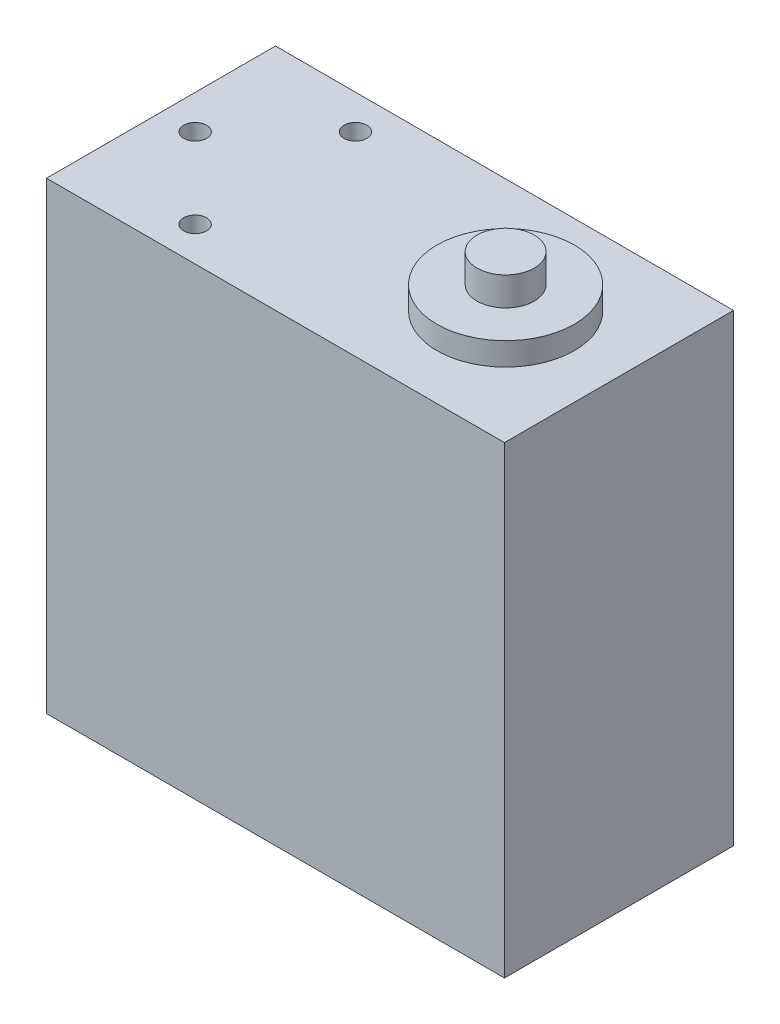
ISO-10303-21;
HEADER;
FILE_DESCRIPTION(('STEP AP214'),'2;1');
FILE_NAME('part.step','',(''),(''),'','','');
FILE_SCHEMA(('AUTOMOTIVE_DESIGN { 1 0 10303 214 1 1 1 1 }'));
ENDSEC;
DATA;
#1=APPLICATION_CONTEXT('core data for automotive mechanical design processes');
#2=APPLICATION_PROTOCOL_DEFINITION('international standard','automotive_design',2000,#1);
#3=PRODUCT_CONTEXT('',#1,'mechanical');
#4=PRODUCT('Part','Part','',(#3));
#5=PRODUCT_RELATED_PRODUCT_CATEGORY('part','',(#4));
#6=PRODUCT_DEFINITION_FORMATION('','',#4);
#7=PRODUCT_DEFINITION_CONTEXT('part definition',#1,'design');
#8=PRODUCT_DEFINITION('design','',#6,#7);
#9=PRODUCT_DEFINITION_SHAPE('','',#8);
#10=(LENGTH_UNIT() NAMED_UNIT(*) SI_UNIT(.MILLI.,.METRE.));
#11=(NAMED_UNIT(*) PLANE_ANGLE_UNIT() SI_UNIT($,.RADIAN.));
#12=(NAMED_UNIT(*) SI_UNIT($,.STERADIAN.) SOLID_ANGLE_UNIT());
#13=UNCERTAINTY_MEASURE_WITH_UNIT(LENGTH_MEASURE(1.E-05),#10,'distance_accuracy_value','');
#14=(GEOMETRIC_REPRESENTATION_CONTEXT(3) GLOBAL_UNCERTAINTY_ASSIGNED_CONTEXT((#13)) GLOBAL_UNIT_ASSIGNED_CONTEXT((#10,
#11,#12)) REPRESENTATION_CONTEXT('',''));
#15=CARTESIAN_POINT('',(0.,0.,0.));
#16=DIRECTION('',(0.,0.,1.));
#17=DIRECTION('',(1.,0.,0.));
#18=AXIS2_PLACEMENT_3D('',#15,#16,#17);
#19=CARTESIAN_POINT('',(0.,0.,20.));
#20=DIRECTION('',(1.,0.,0.));
#21=DIRECTION('',(0.,0.,-1.));
#22=AXIS2_PLACEMENT_3D('',#19,#20,#21);
#23=PLANE('',#22);
#24=DIRECTION('',(0.,-1.,0.));
#25=VECTOR('',#24,1.);
#26=CARTESIAN_POINT('',(0.,0.,0.));
#27=LINE('',#26,#25);
#28=CARTESIAN_POINT('',(0.,40.5,0.));
#29=VERTEX_POINT('',#28);
#30=CARTESIAN_POINT('',(0.,0.,0.));
#31=VERTEX_POINT('',#30);
#32=EDGE_CURVE('E102',#29,#31,#27,.T.);
#33=ORIENTED_EDGE('',*,*,#32,.T.);
#34=DIRECTION('',(0.,0.,-1.));
#35=VECTOR('',#34,1.);
#36=CARTESIAN_POINT('',(0.,0.,20.));
#37=LINE('',#36,#35);
#38=CARTESIAN_POINT('',(0.,0.,20.));
#39=VERTEX_POINT('',#38);
#40=EDGE_CURVE('E44',#39,#31,#37,.T.);
#41=ORIENTED_EDGE('',*,*,#40,.F.);
#42=DIRECTION('',(0.,-1.,0.));
#43=VECTOR('',#42,1.);
#44=CARTESIAN_POINT('',(0.,0.,20.));
#45=LINE('',#44,#43);
#46=CARTESIAN_POINT('',(0.,40.5,20.));
#47=VERTEX_POINT('',#46);
#48=EDGE_CURVE('E88',#47,#39,#45,.T.);
#49=ORIENTED_EDGE('',*,*,#48,.F.);
#50=DIRECTION('',(0.,0.,-1.));
#51=VECTOR('',#50,1.);
#52=CARTESIAN_POINT('',(0.,40.5,20.));
#53=LINE('',#52,#51);
#54=EDGE_CURVE('E98',#47,#29,#53,.T.);
#55=ORIENTED_EDGE('',*,*,#54,.T.);
#56=EDGE_LOOP('',(#33,#41,#49,#55));
#57=FACE_BOUND('',#56,.T.);
#58=ADVANCED_FACE('F36',(#57),#23,.F.);
#59=CARTESIAN_POINT('',(0.,0.,20.));
#60=DIRECTION('',(0.,1.,0.));
#61=DIRECTION('',(0.,0.,1.));
#62=AXIS2_PLACEMENT_3D('',#59,#60,#61);
#63=PLANE('',#62);
#64=CARTESIAN_POINT('',(17.5,0.,17.5));
#65=DIRECTION('',(0.,-1.,0.));
#66=DIRECTION('',(0.,0.,-1.));
#67=AXIS2_PLACEMENT_3D('',#64,#65,#66);
#68=CIRCLE('',#67,1.);
#69=CARTESIAN_POINT('',(17.5,0.,16.5));
#70=VERTEX_POINT('',#69);
#71=EDGE_CURVE('E279',#70,#70,#68,.T.);
#72=ORIENTED_EDGE('',*,*,#71,.F.);
#73=EDGE_LOOP('',(#72));
#74=FACE_BOUND('',#73,.T.);
#75=CARTESIAN_POINT('',(17.5000000000002,0.,2.5));
#76=DIRECTION('',(0.,-1.,0.));
#77=DIRECTION('',(0.,0.,-1.));
#78=AXIS2_PLACEMENT_3D('',#75,#76,#77);
#79=CIRCLE('',#78,1.);
#80=CARTESIAN_POINT('',(17.5000000000002,0.,1.5));
#81=VERTEX_POINT('',#80);
#82=EDGE_CURVE('E290',#81,#81,#79,.T.);
#83=ORIENTED_EDGE('',*,*,#82,.F.);
#84=EDGE_LOOP('',(#83));
#85=FACE_BOUND('',#84,.T.);
#86=CARTESIAN_POINT('',(2.50000000000016,0.,2.5));
#87=DIRECTION('',(0.,-1.,0.));
#88=DIRECTION('',(0.,0.,-1.));
#89=AXIS2_PLACEMENT_3D('',#86,#87,#88);
#90=CIRCLE('',#89,1.);
#91=CARTESIAN_POINT('',(2.50000000000016,0.,1.5));
#92=VERTEX_POINT('',#91);
#93=EDGE_CURVE('E296',#92,#92,#90,.T.);
#94=ORIENTED_EDGE('',*,*,#93,.F.);
#95=EDGE_LOOP('',(#94));
#96=FACE_BOUND('',#95,.T.);
#97=CARTESIAN_POINT('',(2.5,0.,17.5));
#98=DIRECTION('',(0.,-1.,0.));
#99=DIRECTION('',(0.,0.,-1.));
#100=AXIS2_PLACEMENT_3D('',#97,#98,#99);
#101=CIRCLE('',#100,1.);
#102=CARTESIAN_POINT('',(2.5,0.,16.5));
#103=VERTEX_POINT('',#102);
#104=EDGE_CURVE('E278',#103,#103,#101,.T.);
#105=ORIENTED_EDGE('',*,*,#104,.F.);
#106=EDGE_LOOP('',(#105));
#107=FACE_BOUND('',#106,.T.);
#108=CARTESIAN_POINT('',(30.1,0.,10.));
#109=DIRECTION('',(0.,1.,0.));
#110=DIRECTION('',(0.,0.,1.));
#111=AXIS2_PLACEMENT_3D('',#108,#109,#110);
#112=CIRCLE('',#111,6.);
#113=CARTESIAN_POINT('',(30.1,0.,16.));
#114=VERTEX_POINT('',#113);
#115=EDGE_CURVE('E176',#114,#114,#112,.T.);
#116=ORIENTED_EDGE('',*,*,#115,.T.);
#117=EDGE_LOOP('',(#116));
#118=FACE_BOUND('',#117,.T.);
#119=DIRECTION('',(1.,0.,0.));
#120=VECTOR('',#119,1.);
#121=CARTESIAN_POINT('',(0.,0.,0.));
#122=LINE('',#121,#120);
#123=CARTESIAN_POINT('',(40.,0.,0.));
#124=VERTEX_POINT('',#123);
#125=EDGE_CURVE('E93',#31,#124,#122,.T.);
#126=ORIENTED_EDGE('',*,*,#125,.T.);
#127=DIRECTION('',(0.,0.,-1.));
#128=VECTOR('',#127,1.);
#129=CARTESIAN_POINT('',(40.,0.,20.));
#130=LINE('',#129,#128);
#131=CARTESIAN_POINT('',(40.,0.,20.));
#132=VERTEX_POINT('',#131);
#133=EDGE_CURVE('E91',#132,#124,#130,.T.);
#134=ORIENTED_EDGE('',*,*,#133,.F.);
#135=DIRECTION('',(1.,0.,0.));
#136=VECTOR('',#135,1.);
#137=CARTESIAN_POINT('',(0.,0.,20.));
#138=LINE('',#137,#136);
#139=EDGE_CURVE('E83',#39,#132,#138,.T.);
#140=ORIENTED_EDGE('',*,*,#139,.F.);
#141=ORIENTED_EDGE('',*,*,#40,.T.);
#142=EDGE_LOOP('',(#126,#134,#140,#141));
#143=FACE_BOUND('',#142,.T.);
#144=ADVANCED_FACE('F92',(#74,#85,#96,#107,#118,#143),#63,.F.);
#145=CARTESIAN_POINT('',(40.,0.,20.));
#146=DIRECTION('',(-1.,0.,0.));
#147=DIRECTION('',(0.,0.,1.));
#148=AXIS2_PLACEMENT_3D('',#145,#146,#147);
#149=PLANE('',#148);
#150=DIRECTION('',(0.,1.,0.));
#151=VECTOR('',#150,1.);
#152=CARTESIAN_POINT('',(40.,0.,0.));
#153=LINE('',#152,#151);
#154=CARTESIAN_POINT('',(40.,40.5,0.));
#155=VERTEX_POINT('',#154);
#156=EDGE_CURVE('E69',#124,#155,#153,.T.);
#157=ORIENTED_EDGE('',*,*,#156,.T.);
#158=DIRECTION('',(0.,0.,-1.));
#159=VECTOR('',#158,1.);
#160=CARTESIAN_POINT('',(40.,40.5,20.));
#161=LINE('',#160,#159);
#162=CARTESIAN_POINT('',(40.,40.5,20.));
#163=VERTEX_POINT('',#162);
#164=EDGE_CURVE('E94',#163,#155,#161,.T.);
#165=ORIENTED_EDGE('',*,*,#164,.F.);
#166=DIRECTION('',(0.,1.,0.));
#167=VECTOR('',#166,1.);
#168=CARTESIAN_POINT('',(40.,0.,20.));
#169=LINE('',#168,#167);
#170=EDGE_CURVE('E86',#132,#163,#169,.T.);
#171=ORIENTED_EDGE('',*,*,#170,.F.);
#172=ORIENTED_EDGE('',*,*,#133,.T.);
#173=EDGE_LOOP('',(#157,#165,#171,#172));
#174=FACE_BOUND('',#173,.T.);
#175=ADVANCED_FACE('F96',(#174),#149,.F.);
#176=CARTESIAN_POINT('',(0.,40.5,20.));
#177=DIRECTION('',(0.,-1.,0.));
#178=DIRECTION('',(0.,0.,-1.));
#179=AXIS2_PLACEMENT_3D('',#176,#177,#178);
#180=PLANE('',#179);
#181=CARTESIAN_POINT('',(9.98000000000015,40.5,17.));
#182=DIRECTION('',(0.,1.,0.));
#183=DIRECTION('',(0.,0.,1.));
#184=AXIS2_PLACEMENT_3D('',#181,#182,#183);
#185=CIRCLE('',#184,1.);
#186=CARTESIAN_POINT('',(9.98000000000015,40.5,18.));
#187=VERTEX_POINT('',#186);
#188=EDGE_CURVE('E145',#187,#187,#185,.T.);
#189=ORIENTED_EDGE('',*,*,#188,.F.);
#190=EDGE_LOOP('',(#189));
#191=FACE_BOUND('',#190,.T.);
#192=CARTESIAN_POINT('',(2.98,40.5,10.));
#193=DIRECTION('',(0.,1.,0.));
#194=DIRECTION('',(0.,0.,1.));
#195=AXIS2_PLACEMENT_3D('',#192,#193,#194);
#196=CIRCLE('',#195,0.999999999999999);
#197=CARTESIAN_POINT('',(2.98,40.5,11.));
#198=VERTEX_POINT('',#197);
#199=EDGE_CURVE('E149',#198,#198,#196,.T.);
#200=ORIENTED_EDGE('',*,*,#199,.F.);
#201=EDGE_LOOP('',(#200));
#202=FACE_BOUND('',#201,.T.);
#203=CARTESIAN_POINT('',(9.98,40.5,3.));
#204=DIRECTION('',(0.,1.,0.));
#205=DIRECTION('',(0.,0.,1.));
#206=AXIS2_PLACEMENT_3D('',#203,#204,#205);
#207=CIRCLE('',#206,1.);
#208=CARTESIAN_POINT('',(9.98,40.5,4.));
#209=VERTEX_POINT('',#208);
#210=EDGE_CURVE('E153',#209,#209,#207,.T.);
#211=ORIENTED_EDGE('',*,*,#210,.F.);
#212=EDGE_LOOP('',(#211));
#213=FACE_BOUND('',#212,.T.);
#214=CARTESIAN_POINT('',(30.1,40.5,10.));
#215=DIRECTION('',(0.,-1.,0.));
#216=DIRECTION('',(0.,0.,-1.));
#217=AXIS2_PLACEMENT_3D('',#214,#215,#216);
#218=CIRCLE('',#217,6.);
#219=CARTESIAN_POINT('',(30.1,40.5,4.));
#220=VERTEX_POINT('',#219);
#221=EDGE_CURVE('E11',#220,#220,#218,.F.);
#222=ORIENTED_EDGE('',*,*,#221,.F.);
#223=EDGE_LOOP('',(#222));
#224=FACE_BOUND('',#223,.T.);
#225=DIRECTION('',(-1.,0.,0.));
#226=VECTOR('',#225,1.);
#227=CARTESIAN_POINT('',(0.,40.5,0.));
#228=LINE('',#227,#226);
#229=EDGE_CURVE('E75',#155,#29,#228,.T.);
#230=ORIENTED_EDGE('',*,*,#229,.T.);
#231=ORIENTED_EDGE('',*,*,#54,.F.);
#232=DIRECTION('',(-1.,0.,0.));
#233=VECTOR('',#232,1.);
#234=CARTESIAN_POINT('',(0.,40.5,20.));
#235=LINE('',#234,#233);
#236=EDGE_CURVE('E52',#163,#47,#235,.T.);
#237=ORIENTED_EDGE('',*,*,#236,.F.);
#238=ORIENTED_EDGE('',*,*,#164,.T.);
#239=EDGE_LOOP('',(#230,#231,#237,#238));
#240=FACE_BOUND('',#239,.T.);
#241=ADVANCED_FACE('F124',(#191,#202,#213,#224,#240),#180,.F.);
#242=CARTESIAN_POINT('',(0.,0.,20.));
#243=DIRECTION('',(0.,0.,-1.));
#244=DIRECTION('',(-1.,0.,0.));
#245=AXIS2_PLACEMENT_3D('',#242,#243,#244);
#246=PLANE('',#245);
#247=ORIENTED_EDGE('',*,*,#48,.T.);
#248=ORIENTED_EDGE('',*,*,#139,.T.);
#249=ORIENTED_EDGE('',*,*,#170,.T.);
#250=ORIENTED_EDGE('',*,*,#236,.T.);
#251=EDGE_LOOP('',(#247,#248,#249,#250));
#252=FACE_BOUND('',#251,.T.);
#253=ADVANCED_FACE('F84',(#252),#246,.F.);
#254=CARTESIAN_POINT('',(0.,0.,0.));
#255=DIRECTION('',(0.,0.,-1.));
#256=DIRECTION('',(-1.,0.,0.));
#257=AXIS2_PLACEMENT_3D('',#254,#255,#256);
#258=PLANE('',#257);
#259=ORIENTED_EDGE('',*,*,#32,.F.);
#260=ORIENTED_EDGE('',*,*,#229,.F.);
#261=ORIENTED_EDGE('',*,*,#156,.F.);
#262=ORIENTED_EDGE('',*,*,#125,.F.);
#263=EDGE_LOOP('',(#259,#260,#261,#262));
#264=FACE_BOUND('',#263,.T.);
#265=ADVANCED_FACE('F113',(#264),#258,.T.);
#266=CARTESIAN_POINT('',(30.1,42.5,10.));
#267=DIRECTION('',(0.,-1.,0.));
#268=DIRECTION('',(0.,0.,-1.));
#269=AXIS2_PLACEMENT_3D('',#266,#267,#268);
#270=CYLINDRICAL_SURFACE('',#269,6.);
#271=CARTESIAN_POINT('',(30.1,42.5,10.));
#272=DIRECTION('',(0.,1.,0.));
#273=DIRECTION('',(0.,0.,1.));
#274=AXIS2_PLACEMENT_3D('',#271,#272,#273);
#275=CIRCLE('',#274,6.);
#276=CARTESIAN_POINT('',(30.1,42.5,16.));
#277=VERTEX_POINT('',#276);
#278=EDGE_CURVE('E105',#277,#277,#275,.T.);
#279=ORIENTED_EDGE('',*,*,#278,.F.);
#280=EDGE_LOOP('',(#279));
#281=FACE_BOUND('',#280,.T.);
#282=ORIENTED_EDGE('',*,*,#221,.T.);
#283=EDGE_LOOP('',(#282));
#284=FACE_BOUND('',#283,.T.);
#285=ADVANCED_FACE('F115',(#281,#284),#270,.T.);
#286=CARTESIAN_POINT('',(30.1,42.5,10.));
#287=DIRECTION('',(0.,1.,0.));
#288=DIRECTION('',(0.,0.,1.));
#289=AXIS2_PLACEMENT_3D('',#286,#287,#288);
#290=PLANE('',#289);
#291=CARTESIAN_POINT('',(30.1,42.5,10.));
#292=DIRECTION('',(0.,1.,0.));
#293=DIRECTION('',(0.,0.,1.));
#294=AXIS2_PLACEMENT_3D('',#291,#292,#293);
#295=CIRCLE('',#294,2.5);
#296=CARTESIAN_POINT('',(30.1,42.5,12.5));
#297=VERTEX_POINT('',#296);
#298=EDGE_CURVE('E170',#297,#297,#295,.T.);
#299=ORIENTED_EDGE('',*,*,#298,.F.);
#300=EDGE_LOOP('',(#299));
#301=FACE_BOUND('',#300,.T.);
#302=ORIENTED_EDGE('',*,*,#278,.T.);
#303=EDGE_LOOP('',(#302));
#304=FACE_BOUND('',#303,.T.);
#305=ADVANCED_FACE('F121',(#301,#304),#290,.T.);
#306=CARTESIAN_POINT('',(30.1,-2.,10.));
#307=DIRECTION('',(0.,1.,0.));
#308=DIRECTION('',(0.,0.,1.));
#309=AXIS2_PLACEMENT_3D('',#306,#307,#308);
#310=CYLINDRICAL_SURFACE('',#309,6.);
#311=CARTESIAN_POINT('',(30.1,-2.,10.));
#312=DIRECTION('',(0.,1.,0.));
#313=DIRECTION('',(0.,0.,1.));
#314=AXIS2_PLACEMENT_3D('',#311,#312,#313);
#315=CIRCLE('',#314,6.);
#316=CARTESIAN_POINT('',(30.1,-2.,16.));
#317=VERTEX_POINT('',#316);
#318=EDGE_CURVE('E179',#317,#317,#315,.T.);
#319=ORIENTED_EDGE('',*,*,#318,.T.);
#320=EDGE_LOOP('',(#319));
#321=FACE_BOUND('',#320,.T.);
#322=ORIENTED_EDGE('',*,*,#115,.F.);
#323=EDGE_LOOP('',(#322));
#324=FACE_BOUND('',#323,.T.);
#325=ADVANCED_FACE('F188',(#321,#324),#310,.T.);
#326=CARTESIAN_POINT('',(30.1,-2.,10.));
#327=DIRECTION('',(0.,-1.,0.));
#328=DIRECTION('',(0.,0.,1.));
#329=AXIS2_PLACEMENT_3D('',#326,#327,#328);
#330=PLANE('',#329);
#331=CARTESIAN_POINT('',(30.1,-2.,10.));
#332=DIRECTION('',(0.,-1.,0.));
#333=DIRECTION('',(0.,0.,-1.));
#334=AXIS2_PLACEMENT_3D('',#331,#332,#333);
#335=CIRCLE('',#334,2.5);
#336=CARTESIAN_POINT('',(30.1,-2.,7.5));
#337=VERTEX_POINT('',#336);
#338=EDGE_CURVE('E161',#337,#337,#335,.T.);
#339=ORIENTED_EDGE('',*,*,#338,.F.);
#340=EDGE_LOOP('',(#339));
#341=FACE_BOUND('',#340,.T.);
#342=ORIENTED_EDGE('',*,*,#318,.F.);
#343=EDGE_LOOP('',(#342));
#344=FACE_BOUND('',#343,.T.);
#345=ADVANCED_FACE('F194',(#341,#344),#330,.T.);
#346=CARTESIAN_POINT('',(30.1,45.,10.));
#347=DIRECTION('',(0.,-1.,0.));
#348=DIRECTION('',(0.,0.,-1.));
#349=AXIS2_PLACEMENT_3D('',#346,#347,#348);
#350=CYLINDRICAL_SURFACE('',#349,2.5);
#351=CARTESIAN_POINT('',(30.1,45.,10.));
#352=DIRECTION('',(0.,1.,0.));
#353=DIRECTION('',(0.,0.,1.));
#354=AXIS2_PLACEMENT_3D('',#351,#352,#353);
#355=CIRCLE('',#354,2.5);
#356=CARTESIAN_POINT('',(30.1,45.,12.5));
#357=VERTEX_POINT('',#356);
#358=EDGE_CURVE('E173',#357,#357,#355,.T.);
#359=ORIENTED_EDGE('',*,*,#358,.F.);
#360=EDGE_LOOP('',(#359));
#361=FACE_BOUND('',#360,.T.);
#362=ORIENTED_EDGE('',*,*,#298,.T.);
#363=EDGE_LOOP('',(#362));
#364=FACE_BOUND('',#363,.T.);
#365=ADVANCED_FACE('F201',(#361,#364),#350,.T.);
#366=CARTESIAN_POINT('',(30.1,45.,10.));
#367=DIRECTION('',(0.,1.,0.));
#368=DIRECTION('',(0.,0.,1.));
#369=AXIS2_PLACEMENT_3D('',#366,#367,#368);
#370=PLANE('',#369);
#371=ORIENTED_EDGE('',*,*,#358,.T.);
#372=EDGE_LOOP('',(#371));
#373=FACE_BOUND('',#372,.T.);
#374=ADVANCED_FACE('F205',(#373),#370,.T.);
#375=CARTESIAN_POINT('',(30.1,-4.5,10.));
#376=DIRECTION('',(0.,1.,0.));
#377=DIRECTION('',(0.,0.,1.));
#378=AXIS2_PLACEMENT_3D('',#375,#376,#377);
#379=CYLINDRICAL_SURFACE('',#378,2.5);
#380=CARTESIAN_POINT('',(30.1,-4.5,10.));
#381=DIRECTION('',(0.,-1.,0.));
#382=DIRECTION('',(0.,0.,-1.));
#383=AXIS2_PLACEMENT_3D('',#380,#381,#382);
#384=CIRCLE('',#383,2.5);
#385=CARTESIAN_POINT('',(30.1,-4.5,7.5));
#386=VERTEX_POINT('',#385);
#387=EDGE_CURVE('E167',#386,#386,#384,.T.);
#388=ORIENTED_EDGE('',*,*,#387,.F.);
#389=EDGE_LOOP('',(#388));
#390=FACE_BOUND('',#389,.T.);
#391=ORIENTED_EDGE('',*,*,#338,.T.);
#392=EDGE_LOOP('',(#391));
#393=FACE_BOUND('',#392,.T.);
#394=ADVANCED_FACE('F209',(#390,#393),#379,.T.);
#395=CARTESIAN_POINT('',(30.1,-4.5,10.));
#396=DIRECTION('',(0.,-1.,0.));
#397=DIRECTION('',(0.,0.,-1.));
#398=AXIS2_PLACEMENT_3D('',#395,#396,#397);
#399=PLANE('',#398);
#400=ORIENTED_EDGE('',*,*,#387,.T.);
#401=EDGE_LOOP('',(#400));
#402=FACE_BOUND('',#401,.T.);
#403=ADVANCED_FACE('F213',(#402),#399,.T.);
#404=CARTESIAN_POINT('',(9.98,38.,3.));
#405=DIRECTION('',(0.,1.,0.));
#406=DIRECTION('',(0.,0.,1.));
#407=AXIS2_PLACEMENT_3D('',#404,#405,#406);
#408=CYLINDRICAL_SURFACE('',#407,1.);
#409=CARTESIAN_POINT('',(9.98,38.,3.));
#410=DIRECTION('',(0.,1.,0.));
#411=DIRECTION('',(0.,0.,1.));
#412=AXIS2_PLACEMENT_3D('',#409,#410,#411);
#413=CIRCLE('',#412,1.);
#414=CARTESIAN_POINT('',(9.98,38.,4.));
#415=VERTEX_POINT('',#414);
#416=EDGE_CURVE('E157',#415,#415,#413,.T.);
#417=ORIENTED_EDGE('',*,*,#416,.F.);
#418=EDGE_LOOP('',(#417));
#419=FACE_BOUND('',#418,.T.);
#420=ORIENTED_EDGE('',*,*,#210,.T.);
#421=EDGE_LOOP('',(#420));
#422=FACE_BOUND('',#421,.T.);
#423=ADVANCED_FACE('F217',(#419,#422),#408,.F.);
#424=CARTESIAN_POINT('',(9.98,38.,3.));
#425=DIRECTION('',(0.,1.,0.));
#426=DIRECTION('',(0.,0.,1.));
#427=AXIS2_PLACEMENT_3D('',#424,#425,#426);
#428=PLANE('',#427);
#429=ORIENTED_EDGE('',*,*,#416,.T.);
#430=EDGE_LOOP('',(#429));
#431=FACE_BOUND('',#430,.T.);
#432=ADVANCED_FACE('F221',(#431),#428,.T.);
#433=CARTESIAN_POINT('',(2.98,38.,10.));
#434=DIRECTION('',(0.,1.,0.));
#435=DIRECTION('',(0.,0.,1.));
#436=AXIS2_PLACEMENT_3D('',#433,#434,#435);
#437=CYLINDRICAL_SURFACE('',#436,0.999999999999999);
#438=CARTESIAN_POINT('',(2.98,38.,10.));
#439=DIRECTION('',(0.,1.,0.));
#440=DIRECTION('',(0.,0.,1.));
#441=AXIS2_PLACEMENT_3D('',#438,#439,#440);
#442=CIRCLE('',#441,0.999999999999999);
#443=CARTESIAN_POINT('',(2.98,38.,11.));
#444=VERTEX_POINT('',#443);
#445=EDGE_CURVE('E302',#444,#444,#442,.T.);
#446=ORIENTED_EDGE('',*,*,#445,.F.);
#447=EDGE_LOOP('',(#446));
#448=FACE_BOUND('',#447,.T.);
#449=ORIENTED_EDGE('',*,*,#199,.T.);
#450=EDGE_LOOP('',(#449));
#451=FACE_BOUND('',#450,.T.);
#452=ADVANCED_FACE('F225',(#448,#451),#437,.F.);
#453=CARTESIAN_POINT('',(2.98,38.,10.));
#454=DIRECTION('',(0.,1.,0.));
#455=DIRECTION('',(0.,0.,1.));
#456=AXIS2_PLACEMENT_3D('',#453,#454,#455);
#457=PLANE('',#456);
#458=ORIENTED_EDGE('',*,*,#445,.T.);
#459=EDGE_LOOP('',(#458));
#460=FACE_BOUND('',#459,.T.);
#461=ADVANCED_FACE('F229',(#460),#457,.T.);
#462=CARTESIAN_POINT('',(9.98000000000015,38.,17.));
#463=DIRECTION('',(0.,1.,0.));
#464=DIRECTION('',(0.,0.,1.));
#465=AXIS2_PLACEMENT_3D('',#462,#463,#464);
#466=CYLINDRICAL_SURFACE('',#465,1.);
#467=CARTESIAN_POINT('',(9.98000000000015,38.,17.));
#468=DIRECTION('',(0.,1.,0.));
#469=DIRECTION('',(0.,0.,1.));
#470=AXIS2_PLACEMENT_3D('',#467,#468,#469);
#471=CIRCLE('',#470,1.);
#472=CARTESIAN_POINT('',(9.98000000000015,38.,18.));
#473=VERTEX_POINT('',#472);
#474=EDGE_CURVE('E158',#473,#473,#471,.T.);
#475=ORIENTED_EDGE('',*,*,#474,.F.);
#476=EDGE_LOOP('',(#475));
#477=FACE_BOUND('',#476,.T.);
#478=ORIENTED_EDGE('',*,*,#188,.T.);
#479=EDGE_LOOP('',(#478));
#480=FACE_BOUND('',#479,.T.);
#481=ADVANCED_FACE('F233',(#477,#480),#466,.F.);
#482=CARTESIAN_POINT('',(9.98000000000015,38.,17.));
#483=DIRECTION('',(0.,1.,0.));
#484=DIRECTION('',(0.,0.,1.));
#485=AXIS2_PLACEMENT_3D('',#482,#483,#484);
#486=PLANE('',#485);
#487=ORIENTED_EDGE('',*,*,#474,.T.);
#488=EDGE_LOOP('',(#487));
#489=FACE_BOUND('',#488,.T.);
#490=ADVANCED_FACE('F237',(#489),#486,.T.);
#491=CARTESIAN_POINT('',(2.5,2.5,17.5));
#492=DIRECTION('',(0.,-1.,0.));
#493=DIRECTION('',(0.,0.,-1.));
#494=AXIS2_PLACEMENT_3D('',#491,#492,#493);
#495=CYLINDRICAL_SURFACE('',#494,1.);
#496=CARTESIAN_POINT('',(2.5,2.5,17.5));
#497=DIRECTION('',(0.,-1.,0.));
#498=DIRECTION('',(0.,0.,-1.));
#499=AXIS2_PLACEMENT_3D('',#496,#497,#498);
#500=CIRCLE('',#499,1.);
#501=CARTESIAN_POINT('',(2.5,2.5,16.5));
#502=VERTEX_POINT('',#501);
#503=EDGE_CURVE('E282',#502,#502,#500,.T.);
#504=ORIENTED_EDGE('',*,*,#503,.F.);
#505=EDGE_LOOP('',(#504));
#506=FACE_BOUND('',#505,.T.);
#507=ORIENTED_EDGE('',*,*,#104,.T.);
#508=EDGE_LOOP('',(#507));
#509=FACE_BOUND('',#508,.T.);
#510=ADVANCED_FACE('F241',(#506,#509),#495,.F.);
#511=CARTESIAN_POINT('',(2.5,2.5,17.5));
#512=DIRECTION('',(0.,-1.,0.));
#513=DIRECTION('',(0.,0.,-1.));
#514=AXIS2_PLACEMENT_3D('',#511,#512,#513);
#515=PLANE('',#514);
#516=ORIENTED_EDGE('',*,*,#503,.T.);
#517=EDGE_LOOP('',(#516));
#518=FACE_BOUND('',#517,.T.);
#519=ADVANCED_FACE('F245',(#518),#515,.T.);
#520=CARTESIAN_POINT('',(2.50000000000016,2.5,2.5));
#521=DIRECTION('',(0.,-1.,0.));
#522=DIRECTION('',(0.,0.,-1.));
#523=AXIS2_PLACEMENT_3D('',#520,#521,#522);
#524=CYLINDRICAL_SURFACE('',#523,1.);
#525=CARTESIAN_POINT('',(2.50000000000016,2.5,2.5));
#526=DIRECTION('',(0.,-1.,0.));
#527=DIRECTION('',(0.,0.,-1.));
#528=AXIS2_PLACEMENT_3D('',#525,#526,#527);
#529=CIRCLE('',#528,1.);
#530=CARTESIAN_POINT('',(2.50000000000016,2.5,1.5));
#531=VERTEX_POINT('',#530);
#532=EDGE_CURVE('E293',#531,#531,#529,.T.);
#533=ORIENTED_EDGE('',*,*,#532,.F.);
#534=EDGE_LOOP('',(#533));
#535=FACE_BOUND('',#534,.T.);
#536=ORIENTED_EDGE('',*,*,#93,.T.);
#537=EDGE_LOOP('',(#536));
#538=FACE_BOUND('',#537,.T.);
#539=ADVANCED_FACE('F249',(#535,#538),#524,.F.);
#540=CARTESIAN_POINT('',(2.50000000000016,2.5,2.5));
#541=DIRECTION('',(0.,-1.,0.));
#542=DIRECTION('',(0.,0.,-1.));
#543=AXIS2_PLACEMENT_3D('',#540,#541,#542);
#544=PLANE('',#543);
#545=ORIENTED_EDGE('',*,*,#532,.T.);
#546=EDGE_LOOP('',(#545));
#547=FACE_BOUND('',#546,.T.);
#548=ADVANCED_FACE('F253',(#547),#544,.T.);
#549=CARTESIAN_POINT('',(17.5000000000002,2.5,2.5));
#550=DIRECTION('',(0.,-1.,0.));
#551=DIRECTION('',(0.,0.,-1.));
#552=AXIS2_PLACEMENT_3D('',#549,#550,#551);
#553=CYLINDRICAL_SURFACE('',#552,1.);
#554=CARTESIAN_POINT('',(17.5000000000002,2.5,2.5));
#555=DIRECTION('',(0.,-1.,0.));
#556=DIRECTION('',(0.,0.,-1.));
#557=AXIS2_PLACEMENT_3D('',#554,#555,#556);
#558=CIRCLE('',#557,1.);
#559=CARTESIAN_POINT('',(17.5000000000002,2.5,1.5));
#560=VERTEX_POINT('',#559);
#561=EDGE_CURVE('E285',#560,#560,#558,.T.);
#562=ORIENTED_EDGE('',*,*,#561,.F.);
#563=EDGE_LOOP('',(#562));
#564=FACE_BOUND('',#563,.T.);
#565=ORIENTED_EDGE('',*,*,#82,.T.);
#566=EDGE_LOOP('',(#565));
#567=FACE_BOUND('',#566,.T.);
#568=ADVANCED_FACE('F257',(#564,#567),#553,.F.);
#569=CARTESIAN_POINT('',(17.5000000000002,2.5,2.5));
#570=DIRECTION('',(0.,-1.,0.));
#571=DIRECTION('',(0.,0.,-1.));
#572=AXIS2_PLACEMENT_3D('',#569,#570,#571);
#573=PLANE('',#572);
#574=ORIENTED_EDGE('',*,*,#561,.T.);
#575=EDGE_LOOP('',(#574));
#576=FACE_BOUND('',#575,.T.);
#577=ADVANCED_FACE('F261',(#576),#573,.T.);
#578=CARTESIAN_POINT('',(17.5,2.5,17.5));
#579=DIRECTION('',(0.,-1.,0.));
#580=DIRECTION('',(0.,0.,-1.));
#581=AXIS2_PLACEMENT_3D('',#578,#579,#580);
#582=CYLINDRICAL_SURFACE('',#581,1.);
#583=CARTESIAN_POINT('',(17.5,2.5,17.5));
#584=DIRECTION('',(0.,-1.,0.));
#585=DIRECTION('',(0.,0.,-1.));
#586=AXIS2_PLACEMENT_3D('',#583,#584,#585);
#587=CIRCLE('',#586,1.);
#588=CARTESIAN_POINT('',(17.5,2.5,16.5));
#589=VERTEX_POINT('',#588);
#590=EDGE_CURVE('E277',#589,#589,#587,.T.);
#591=ORIENTED_EDGE('',*,*,#590,.F.);
#592=EDGE_LOOP('',(#591));
#593=FACE_BOUND('',#592,.T.);
#594=ORIENTED_EDGE('',*,*,#71,.T.);
#595=EDGE_LOOP('',(#594));
#596=FACE_BOUND('',#595,.T.);
#597=ADVANCED_FACE('F265',(#593,#596),#582,.F.);
#598=CARTESIAN_POINT('',(17.5,2.5,17.5));
#599=DIRECTION('',(0.,-1.,0.));
#600=DIRECTION('',(0.,0.,-1.));
#601=AXIS2_PLACEMENT_3D('',#598,#599,#600);
#602=PLANE('',#601);
#603=ORIENTED_EDGE('',*,*,#590,.T.);
#604=EDGE_LOOP('',(#603));
#605=FACE_BOUND('',#604,.T.);
#606=ADVANCED_FACE('F269',(#605),#602,.T.);
#607=CLOSED_SHELL('',(#58,#144,#175,#241,#253,#265,#285,#305,#325,#345,#365,#374,#394,#403,#423,
#432,#452,#461,#481,#490,#510,#519,#539,#548,#568,#577,#597,#606));
#608=MANIFOLD_SOLID_BREP('B2',#607);
#609=ADVANCED_BREP_SHAPE_REPRESENTATION('',(#18,#608),#14);
#610=SHAPE_DEFINITION_REPRESENTATION(#9,#609);
ENDSEC;
END-ISO-10303-21;
